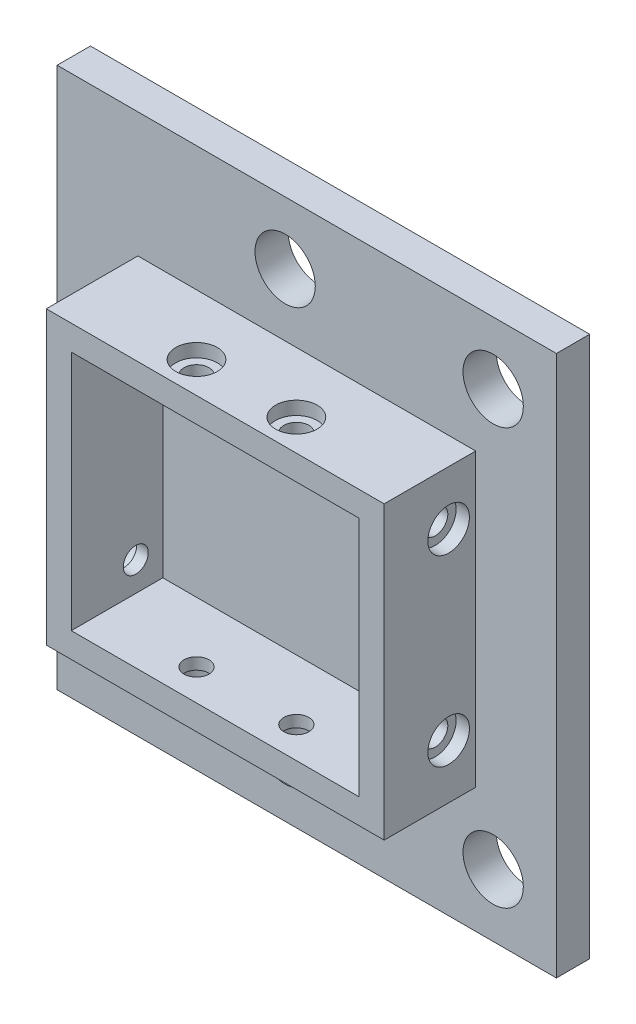
ISO-10303-21;
HEADER;
FILE_DESCRIPTION(('STEP AP214'),'2;1');
FILE_NAME('part.step','',(''),(''),'','','');
FILE_SCHEMA(('AUTOMOTIVE_DESIGN { 1 0 10303 214 1 1 1 1 }'));
ENDSEC;
DATA;
#1=APPLICATION_CONTEXT('core data for automotive mechanical design processes');
#2=APPLICATION_PROTOCOL_DEFINITION('international standard','automotive_design',2000,#1);
#3=PRODUCT_CONTEXT('',#1,'mechanical');
#4=PRODUCT('Part','Part','',(#3));
#5=PRODUCT_RELATED_PRODUCT_CATEGORY('part','',(#4));
#6=PRODUCT_DEFINITION_FORMATION('','',#4);
#7=PRODUCT_DEFINITION_CONTEXT('part definition',#1,'design');
#8=PRODUCT_DEFINITION('design','',#6,#7);
#9=PRODUCT_DEFINITION_SHAPE('','',#8);
#10=(LENGTH_UNIT() NAMED_UNIT(*) SI_UNIT(.MILLI.,.METRE.));
#11=(NAMED_UNIT(*) PLANE_ANGLE_UNIT() SI_UNIT($,.RADIAN.));
#12=(NAMED_UNIT(*) SI_UNIT($,.STERADIAN.) SOLID_ANGLE_UNIT());
#13=UNCERTAINTY_MEASURE_WITH_UNIT(LENGTH_MEASURE(1.E-05),#10,'distance_accuracy_value','');
#14=(GEOMETRIC_REPRESENTATION_CONTEXT(3) GLOBAL_UNCERTAINTY_ASSIGNED_CONTEXT((#13)) GLOBAL_UNIT_ASSIGNED_CONTEXT((#10,
#11,#12)) REPRESENTATION_CONTEXT('',''));
#15=CARTESIAN_POINT('',(0.,0.,0.));
#16=DIRECTION('',(0.,0.,1.));
#17=DIRECTION('',(1.,0.,0.));
#18=AXIS2_PLACEMENT_3D('',#15,#16,#17);
#19=CARTESIAN_POINT('',(30.,11.,7.25));
#20=DIRECTION('',(-1.,0.,0.));
#21=DIRECTION('',(0.,0.,1.));
#22=AXIS2_PLACEMENT_3D('',#19,#20,#21);
#23=CYLINDRICAL_SURFACE('',#22,1.5);
#24=CARTESIAN_POINT('',(17.3,11.,7.25));
#25=DIRECTION('',(-1.,0.,0.));
#26=DIRECTION('',(0.,0.,1.));
#27=AXIS2_PLACEMENT_3D('',#24,#25,#26);
#28=CIRCLE('',#27,1.5);
#29=CARTESIAN_POINT('',(17.3,11.,8.75));
#30=VERTEX_POINT('',#29);
#31=EDGE_CURVE('E273',#30,#30,#28,.T.);
#32=ORIENTED_EDGE('',*,*,#31,.T.);
#33=EDGE_LOOP('',(#32));
#34=FACE_BOUND('',#33,.T.);
#35=CARTESIAN_POINT('',(18.7,11.,7.25));
#36=DIRECTION('',(1.,0.,0.));
#37=DIRECTION('',(0.,0.,-1.));
#38=AXIS2_PLACEMENT_3D('',#35,#36,#37);
#39=CIRCLE('',#38,1.5);
#40=CARTESIAN_POINT('',(18.7,11.,5.75));
#41=VERTEX_POINT('',#40);
#42=EDGE_CURVE('E284',#41,#41,#39,.F.);
#43=ORIENTED_EDGE('',*,*,#42,.F.);
#44=EDGE_LOOP('',(#43));
#45=FACE_BOUND('',#44,.T.);
#46=ADVANCED_FACE('F32',(#34,#45),#23,.F.);
#47=CARTESIAN_POINT('',(-17.3,11.,7.25));
#48=DIRECTION('',(1.,0.,0.));
#49=DIRECTION('',(0.,0.,-1.));
#50=AXIS2_PLACEMENT_3D('',#47,#48,#49);
#51=CIRCLE('',#50,1.5);
#52=CARTESIAN_POINT('',(-17.3,11.,5.75));
#53=VERTEX_POINT('',#52);
#54=EDGE_CURVE('E272',#53,#53,#51,.T.);
#55=ORIENTED_EDGE('',*,*,#54,.T.);
#56=EDGE_LOOP('',(#55));
#57=FACE_BOUND('',#56,.T.);
#58=CARTESIAN_POINT('',(-18.7,11.,7.25));
#59=DIRECTION('',(-1.,0.,0.));
#60=DIRECTION('',(0.,0.,1.));
#61=AXIS2_PLACEMENT_3D('',#58,#59,#60);
#62=CIRCLE('',#61,1.5);
#63=CARTESIAN_POINT('',(-18.7,11.,8.75));
#64=VERTEX_POINT('',#63);
#65=EDGE_CURVE('E276',#64,#64,#62,.F.);
#66=ORIENTED_EDGE('',*,*,#65,.F.);
#67=EDGE_LOOP('',(#66));
#68=FACE_BOUND('',#67,.T.);
#69=ADVANCED_FACE('F353',(#57,#68),#23,.F.);
#70=CARTESIAN_POINT('',(-6.00000000000001,32.5,11.25));
#71=DIRECTION('',(0.,-1.,0.));
#72=DIRECTION('',(1.,0.,0.));
#73=AXIS2_PLACEMENT_3D('',#70,#71,#72);
#74=CYLINDRICAL_SURFACE('',#73,1.5);
#75=CARTESIAN_POINT('',(-6.,14.5,11.25));
#76=DIRECTION('',(0.,-1.,0.));
#77=DIRECTION('',(1.,0.,0.));
#78=AXIS2_PLACEMENT_3D('',#75,#76,#77);
#79=CIRCLE('',#78,1.5);
#80=CARTESIAN_POINT('',(-4.5,14.5,11.25));
#81=VERTEX_POINT('',#80);
#82=EDGE_CURVE('E242',#81,#81,#79,.T.);
#83=ORIENTED_EDGE('',*,*,#82,.T.);
#84=EDGE_LOOP('',(#83));
#85=FACE_BOUND('',#84,.T.);
#86=CARTESIAN_POINT('',(-6.,15.9,11.25));
#87=DIRECTION('',(0.,1.,0.));
#88=DIRECTION('',(-1.,0.,0.));
#89=AXIS2_PLACEMENT_3D('',#86,#87,#88);
#90=CIRCLE('',#89,1.5);
#91=CARTESIAN_POINT('',(-7.5,15.9,11.25));
#92=VERTEX_POINT('',#91);
#93=EDGE_CURVE('E258',#92,#92,#90,.F.);
#94=ORIENTED_EDGE('',*,*,#93,.F.);
#95=EDGE_LOOP('',(#94));
#96=FACE_BOUND('',#95,.T.);
#97=ADVANCED_FACE('F359',(#85,#96),#74,.F.);
#98=CARTESIAN_POINT('',(-6.,-14.5,11.25));
#99=DIRECTION('',(0.,1.,0.));
#100=DIRECTION('',(-1.,0.,0.));
#101=AXIS2_PLACEMENT_3D('',#98,#99,#100);
#102=CIRCLE('',#101,1.5);
#103=CARTESIAN_POINT('',(-7.5,-14.5,11.25));
#104=VERTEX_POINT('',#103);
#105=EDGE_CURVE('E156',#104,#104,#102,.T.);
#106=ORIENTED_EDGE('',*,*,#105,.T.);
#107=EDGE_LOOP('',(#106));
#108=FACE_BOUND('',#107,.T.);
#109=CARTESIAN_POINT('',(-6.,-15.9,11.25));
#110=DIRECTION('',(0.,-1.,0.));
#111=DIRECTION('',(1.,0.,0.));
#112=AXIS2_PLACEMENT_3D('',#109,#110,#111);
#113=CIRCLE('',#112,1.5);
#114=CARTESIAN_POINT('',(-4.5,-15.9,11.25));
#115=VERTEX_POINT('',#114);
#116=EDGE_CURVE('E249',#115,#115,#113,.F.);
#117=ORIENTED_EDGE('',*,*,#116,.F.);
#118=EDGE_LOOP('',(#117));
#119=FACE_BOUND('',#118,.T.);
#120=ADVANCED_FACE('F334',(#108,#119),#74,.F.);
#121=CARTESIAN_POINT('',(0.,0.,4.));
#122=DIRECTION('',(0.,0.,1.));
#123=DIRECTION('',(1.,0.,0.));
#124=AXIS2_PLACEMENT_3D('',#121,#122,#123);
#125=PLANE('',#124);
#126=CARTESIAN_POINT('',(22.4,-25.,4.));
#127=DIRECTION('',(0.,0.,1.));
#128=DIRECTION('',(1.,0.,0.));
#129=AXIS2_PLACEMENT_3D('',#126,#127,#128);
#130=CIRCLE('',#129,3.625);
#131=CARTESIAN_POINT('',(26.025,-25.,4.));
#132=VERTEX_POINT('',#131);
#133=EDGE_CURVE('E193',#132,#132,#130,.T.);
#134=ORIENTED_EDGE('',*,*,#133,.F.);
#135=EDGE_LOOP('',(#134));
#136=FACE_BOUND('',#135,.T.);
#137=CARTESIAN_POINT('',(-2.6,-25.,4.));
#138=DIRECTION('',(0.,0.,1.));
#139=DIRECTION('',(1.,0.,0.));
#140=AXIS2_PLACEMENT_3D('',#137,#138,#139);
#141=CIRCLE('',#140,3.625);
#142=CARTESIAN_POINT('',(1.025,-25.,4.));
#143=VERTEX_POINT('',#142);
#144=EDGE_CURVE('E205',#143,#143,#141,.T.);
#145=ORIENTED_EDGE('',*,*,#144,.F.);
#146=EDGE_LOOP('',(#145));
#147=FACE_BOUND('',#146,.T.);
#148=DIRECTION('',(0.,-1.,0.));
#149=VECTOR('',#148,1.);
#150=CARTESIAN_POINT('',(-30.,-32.5,4.));
#151=LINE('',#150,#149);
#152=CARTESIAN_POINT('',(-30.,32.5,4.));
#153=VERTEX_POINT('',#152);
#154=CARTESIAN_POINT('',(-30.,-32.5,4.));
#155=VERTEX_POINT('',#154);
#156=EDGE_CURVE('E217',#153,#155,#151,.T.);
#157=ORIENTED_EDGE('',*,*,#156,.T.);
#158=DIRECTION('',(1.,0.,0.));
#159=VECTOR('',#158,1.);
#160=CARTESIAN_POINT('',(30.,-32.5,4.));
#161=LINE('',#160,#159);
#162=CARTESIAN_POINT('',(30.,-32.5,4.));
#163=VERTEX_POINT('',#162);
#164=EDGE_CURVE('E220',#155,#163,#161,.T.);
#165=ORIENTED_EDGE('',*,*,#164,.T.);
#166=DIRECTION('',(0.,1.,0.));
#167=VECTOR('',#166,1.);
#168=CARTESIAN_POINT('',(30.,-32.5,4.));
#169=LINE('',#168,#167);
#170=CARTESIAN_POINT('',(30.,32.5,4.));
#171=VERTEX_POINT('',#170);
#172=EDGE_CURVE('E223',#163,#171,#169,.T.);
#173=ORIENTED_EDGE('',*,*,#172,.T.);
#174=DIRECTION('',(-1.,0.,0.));
#175=VECTOR('',#174,1.);
#176=CARTESIAN_POINT('',(30.,32.5,4.));
#177=LINE('',#176,#175);
#178=EDGE_CURVE('E225',#171,#153,#177,.T.);
#179=ORIENTED_EDGE('',*,*,#178,.T.);
#180=EDGE_LOOP('',(#157,#165,#173,#179));
#181=FACE_BOUND('',#180,.T.);
#182=CARTESIAN_POINT('',(-2.6,25.,4.));
#183=DIRECTION('',(0.,0.,1.));
#184=DIRECTION('',(1.,0.,0.));
#185=AXIS2_PLACEMENT_3D('',#182,#183,#184);
#186=CIRCLE('',#185,3.625);
#187=CARTESIAN_POINT('',(1.025,25.,4.));
#188=VERTEX_POINT('',#187);
#189=EDGE_CURVE('E211',#188,#188,#186,.T.);
#190=ORIENTED_EDGE('',*,*,#189,.F.);
#191=EDGE_LOOP('',(#190));
#192=FACE_BOUND('',#191,.T.);
#193=CARTESIAN_POINT('',(22.4,25.,4.));
#194=DIRECTION('',(0.,0.,1.));
#195=DIRECTION('',(1.,0.,0.));
#196=AXIS2_PLACEMENT_3D('',#193,#194,#195);
#197=CIRCLE('',#196,3.625);
#198=CARTESIAN_POINT('',(26.025,25.,4.));
#199=VERTEX_POINT('',#198);
#200=EDGE_CURVE('E199',#199,#199,#197,.T.);
#201=ORIENTED_EDGE('',*,*,#200,.F.);
#202=EDGE_LOOP('',(#201));
#203=FACE_BOUND('',#202,.T.);
#204=DIRECTION('',(1.,0.,0.));
#205=VECTOR('',#204,1.);
#206=CARTESIAN_POINT('',(20.3,-17.5,4.));
#207=LINE('',#206,#205);
#208=CARTESIAN_POINT('',(-20.3,-17.5,4.));
#209=VERTEX_POINT('',#208);
#210=CARTESIAN_POINT('',(20.3,-17.5,4.));
#211=VERTEX_POINT('',#210);
#212=EDGE_CURVE('E179',#209,#211,#207,.T.);
#213=ORIENTED_EDGE('',*,*,#212,.F.);
#214=DIRECTION('',(0.,-1.,0.));
#215=VECTOR('',#214,1.);
#216=CARTESIAN_POINT('',(-20.3,-17.5,4.));
#217=LINE('',#216,#215);
#218=CARTESIAN_POINT('',(-20.3,17.5,4.));
#219=VERTEX_POINT('',#218);
#220=EDGE_CURVE('E142',#219,#209,#217,.T.);
#221=ORIENTED_EDGE('',*,*,#220,.F.);
#222=DIRECTION('',(-1.,0.,0.));
#223=VECTOR('',#222,1.);
#224=CARTESIAN_POINT('',(20.3,17.5,4.));
#225=LINE('',#224,#223);
#226=CARTESIAN_POINT('',(20.3,17.5,4.));
#227=VERTEX_POINT('',#226);
#228=EDGE_CURVE('E170',#227,#219,#225,.T.);
#229=ORIENTED_EDGE('',*,*,#228,.F.);
#230=DIRECTION('',(0.,1.,0.));
#231=VECTOR('',#230,1.);
#232=CARTESIAN_POINT('',(20.3,-17.5,4.));
#233=LINE('',#232,#231);
#234=EDGE_CURVE('E181',#211,#227,#233,.T.);
#235=ORIENTED_EDGE('',*,*,#234,.F.);
#236=EDGE_LOOP('',(#213,#221,#229,#235));
#237=FACE_BOUND('',#236,.T.);
#238=ADVANCED_FACE('F418',(#136,#147,#181,#192,#203,#237),#125,.T.);
#239=CARTESIAN_POINT('',(0.,0.,0.));
#240=DIRECTION('',(0.,0.,1.));
#241=DIRECTION('',(1.,0.,0.));
#242=AXIS2_PLACEMENT_3D('',#239,#240,#241);
#243=PLANE('',#242);
#244=DIRECTION('',(0.,-1.,0.));
#245=VECTOR('',#244,1.);
#246=CARTESIAN_POINT('',(-30.,-32.5,0.));
#247=LINE('',#246,#245);
#248=CARTESIAN_POINT('',(-30.,32.5,0.));
#249=VERTEX_POINT('',#248);
#250=CARTESIAN_POINT('',(-30.,-32.5,0.));
#251=VERTEX_POINT('',#250);
#252=EDGE_CURVE('E214',#249,#251,#247,.T.);
#253=ORIENTED_EDGE('',*,*,#252,.F.);
#254=DIRECTION('',(-1.,0.,0.));
#255=VECTOR('',#254,1.);
#256=CARTESIAN_POINT('',(30.,32.5,0.));
#257=LINE('',#256,#255);
#258=CARTESIAN_POINT('',(30.,32.5,0.));
#259=VERTEX_POINT('',#258);
#260=EDGE_CURVE('E221',#259,#249,#257,.T.);
#261=ORIENTED_EDGE('',*,*,#260,.F.);
#262=DIRECTION('',(0.,1.,0.));
#263=VECTOR('',#262,1.);
#264=CARTESIAN_POINT('',(30.,-32.5,0.));
#265=LINE('',#264,#263);
#266=CARTESIAN_POINT('',(30.,-32.5,0.));
#267=VERTEX_POINT('',#266);
#268=EDGE_CURVE('E232',#267,#259,#265,.T.);
#269=ORIENTED_EDGE('',*,*,#268,.F.);
#270=DIRECTION('',(1.,0.,0.));
#271=VECTOR('',#270,1.);
#272=CARTESIAN_POINT('',(30.,-32.5,0.));
#273=LINE('',#272,#271);
#274=EDGE_CURVE('E230',#251,#267,#273,.T.);
#275=ORIENTED_EDGE('',*,*,#274,.F.);
#276=EDGE_LOOP('',(#253,#261,#269,#275));
#277=FACE_BOUND('',#276,.T.);
#278=CARTESIAN_POINT('',(-2.6,25.,0.));
#279=DIRECTION('',(0.,0.,1.));
#280=DIRECTION('',(1.,0.,0.));
#281=AXIS2_PLACEMENT_3D('',#278,#279,#280);
#282=CIRCLE('',#281,3.625);
#283=CARTESIAN_POINT('',(1.025,25.,0.));
#284=VERTEX_POINT('',#283);
#285=EDGE_CURVE('E208',#284,#284,#282,.T.);
#286=ORIENTED_EDGE('',*,*,#285,.T.);
#287=EDGE_LOOP('',(#286));
#288=FACE_BOUND('',#287,.T.);
#289=CARTESIAN_POINT('',(-2.6,-25.,0.));
#290=DIRECTION('',(0.,0.,1.));
#291=DIRECTION('',(1.,0.,0.));
#292=AXIS2_PLACEMENT_3D('',#289,#290,#291);
#293=CIRCLE('',#292,3.625);
#294=CARTESIAN_POINT('',(1.025,-25.,0.));
#295=VERTEX_POINT('',#294);
#296=EDGE_CURVE('E202',#295,#295,#293,.T.);
#297=ORIENTED_EDGE('',*,*,#296,.T.);
#298=EDGE_LOOP('',(#297));
#299=FACE_BOUND('',#298,.T.);
#300=CARTESIAN_POINT('',(22.4,25.,0.));
#301=DIRECTION('',(0.,0.,1.));
#302=DIRECTION('',(1.,0.,0.));
#303=AXIS2_PLACEMENT_3D('',#300,#301,#302);
#304=CIRCLE('',#303,3.625);
#305=CARTESIAN_POINT('',(26.025,25.,0.));
#306=VERTEX_POINT('',#305);
#307=EDGE_CURVE('E196',#306,#306,#304,.T.);
#308=ORIENTED_EDGE('',*,*,#307,.T.);
#309=EDGE_LOOP('',(#308));
#310=FACE_BOUND('',#309,.T.);
#311=CARTESIAN_POINT('',(22.4,-25.,0.));
#312=DIRECTION('',(0.,0.,1.));
#313=DIRECTION('',(1.,0.,0.));
#314=AXIS2_PLACEMENT_3D('',#311,#312,#313);
#315=CIRCLE('',#314,3.625);
#316=CARTESIAN_POINT('',(26.025,-25.,0.));
#317=VERTEX_POINT('',#316);
#318=EDGE_CURVE('E192',#317,#317,#315,.T.);
#319=ORIENTED_EDGE('',*,*,#318,.T.);
#320=EDGE_LOOP('',(#319));
#321=FACE_BOUND('',#320,.T.);
#322=ADVANCED_FACE('F435',(#277,#288,#299,#310,#321),#243,.F.);
#323=CARTESIAN_POINT('',(-30.,-32.5,4.));
#324=DIRECTION('',(1.,0.,0.));
#325=DIRECTION('',(0.,0.,-1.));
#326=AXIS2_PLACEMENT_3D('',#323,#324,#325);
#327=PLANE('',#326);
#328=ORIENTED_EDGE('',*,*,#252,.T.);
#329=DIRECTION('',(0.,0.,-1.));
#330=VECTOR('',#329,1.);
#331=CARTESIAN_POINT('',(-30.,-32.5,4.));
#332=LINE('',#331,#330);
#333=EDGE_CURVE('E11',#155,#251,#332,.T.);
#334=ORIENTED_EDGE('',*,*,#333,.F.);
#335=ORIENTED_EDGE('',*,*,#156,.F.);
#336=DIRECTION('',(0.,0.,-1.));
#337=VECTOR('',#336,1.);
#338=CARTESIAN_POINT('',(-30.,32.5,4.));
#339=LINE('',#338,#337);
#340=EDGE_CURVE('E227',#153,#249,#339,.T.);
#341=ORIENTED_EDGE('',*,*,#340,.T.);
#342=EDGE_LOOP('',(#328,#334,#335,#341));
#343=FACE_BOUND('',#342,.T.);
#344=ADVANCED_FACE('F34',(#343),#327,.F.);
#345=CARTESIAN_POINT('',(30.,-32.5,4.));
#346=DIRECTION('',(0.,1.,0.));
#347=DIRECTION('',(0.,0.,1.));
#348=AXIS2_PLACEMENT_3D('',#345,#346,#347);
#349=PLANE('',#348);
#350=ORIENTED_EDGE('',*,*,#274,.T.);
#351=DIRECTION('',(0.,0.,-1.));
#352=VECTOR('',#351,1.);
#353=CARTESIAN_POINT('',(30.,-32.5,4.));
#354=LINE('',#353,#352);
#355=EDGE_CURVE('E41',#163,#267,#354,.T.);
#356=ORIENTED_EDGE('',*,*,#355,.F.);
#357=ORIENTED_EDGE('',*,*,#164,.F.);
#358=ORIENTED_EDGE('',*,*,#333,.T.);
#359=EDGE_LOOP('',(#350,#356,#357,#358));
#360=FACE_BOUND('',#359,.T.);
#361=ADVANCED_FACE('F522',(#360),#349,.F.);
#362=CARTESIAN_POINT('',(30.,-32.5,4.));
#363=DIRECTION('',(-1.,0.,0.));
#364=DIRECTION('',(0.,0.,1.));
#365=AXIS2_PLACEMENT_3D('',#362,#363,#364);
#366=PLANE('',#365);
#367=ORIENTED_EDGE('',*,*,#268,.T.);
#368=DIRECTION('',(0.,0.,-1.));
#369=VECTOR('',#368,1.);
#370=CARTESIAN_POINT('',(30.,32.5,4.));
#371=LINE('',#370,#369);
#372=EDGE_CURVE('E237',#171,#259,#371,.T.);
#373=ORIENTED_EDGE('',*,*,#372,.F.);
#374=ORIENTED_EDGE('',*,*,#172,.F.);
#375=ORIENTED_EDGE('',*,*,#355,.T.);
#376=EDGE_LOOP('',(#367,#373,#374,#375));
#377=FACE_BOUND('',#376,.T.);
#378=ADVANCED_FACE('F504',(#377),#366,.F.);
#379=CARTESIAN_POINT('',(30.,32.5,4.));
#380=DIRECTION('',(0.,-1.,0.));
#381=DIRECTION('',(0.,0.,-1.));
#382=AXIS2_PLACEMENT_3D('',#379,#380,#381);
#383=PLANE('',#382);
#384=ORIENTED_EDGE('',*,*,#260,.T.);
#385=ORIENTED_EDGE('',*,*,#340,.F.);
#386=ORIENTED_EDGE('',*,*,#178,.F.);
#387=ORIENTED_EDGE('',*,*,#372,.T.);
#388=EDGE_LOOP('',(#384,#385,#386,#387));
#389=FACE_BOUND('',#388,.T.);
#390=ADVANCED_FACE('F499',(#389),#383,.F.);
#391=CARTESIAN_POINT('',(-2.6,25.,4.));
#392=DIRECTION('',(0.,0.,-1.));
#393=DIRECTION('',(-1.,0.,0.));
#394=AXIS2_PLACEMENT_3D('',#391,#392,#393);
#395=CYLINDRICAL_SURFACE('',#394,3.625);
#396=ORIENTED_EDGE('',*,*,#189,.T.);
#397=EDGE_LOOP('',(#396));
#398=FACE_BOUND('',#397,.T.);
#399=ORIENTED_EDGE('',*,*,#285,.F.);
#400=EDGE_LOOP('',(#399));
#401=FACE_BOUND('',#400,.T.);
#402=ADVANCED_FACE('F496',(#398,#401),#395,.F.);
#403=CARTESIAN_POINT('',(-2.6,-25.,4.));
#404=DIRECTION('',(0.,0.,-1.));
#405=DIRECTION('',(-1.,0.,0.));
#406=AXIS2_PLACEMENT_3D('',#403,#404,#405);
#407=CYLINDRICAL_SURFACE('',#406,3.625);
#408=ORIENTED_EDGE('',*,*,#144,.T.);
#409=EDGE_LOOP('',(#408));
#410=FACE_BOUND('',#409,.T.);
#411=ORIENTED_EDGE('',*,*,#296,.F.);
#412=EDGE_LOOP('',(#411));
#413=FACE_BOUND('',#412,.T.);
#414=ADVANCED_FACE('F493',(#410,#413),#407,.F.);
#415=CARTESIAN_POINT('',(22.4,25.,4.));
#416=DIRECTION('',(0.,0.,-1.));
#417=DIRECTION('',(-1.,0.,0.));
#418=AXIS2_PLACEMENT_3D('',#415,#416,#417);
#419=CYLINDRICAL_SURFACE('',#418,3.625);
#420=ORIENTED_EDGE('',*,*,#200,.T.);
#421=EDGE_LOOP('',(#420));
#422=FACE_BOUND('',#421,.T.);
#423=ORIENTED_EDGE('',*,*,#307,.F.);
#424=EDGE_LOOP('',(#423));
#425=FACE_BOUND('',#424,.T.);
#426=ADVANCED_FACE('F489',(#422,#425),#419,.F.);
#427=CARTESIAN_POINT('',(22.4,-25.,4.));
#428=DIRECTION('',(0.,0.,-1.));
#429=DIRECTION('',(-1.,0.,0.));
#430=AXIS2_PLACEMENT_3D('',#427,#428,#429);
#431=CYLINDRICAL_SURFACE('',#430,3.625);
#432=ORIENTED_EDGE('',*,*,#133,.T.);
#433=EDGE_LOOP('',(#432));
#434=FACE_BOUND('',#433,.T.);
#435=ORIENTED_EDGE('',*,*,#318,.F.);
#436=EDGE_LOOP('',(#435));
#437=FACE_BOUND('',#436,.T.);
#438=ADVANCED_FACE('F486',(#434,#437),#431,.F.);
#439=CARTESIAN_POINT('',(0.,0.,15.));
#440=DIRECTION('',(0.,0.,1.));
#441=DIRECTION('',(1.,0.,0.));
#442=AXIS2_PLACEMENT_3D('',#439,#440,#441);
#443=PLANE('',#442);
#444=DIRECTION('',(0.,-1.,0.));
#445=VECTOR('',#444,1.);
#446=CARTESIAN_POINT('',(-20.3,-17.5,15.));
#447=LINE('',#446,#445);
#448=CARTESIAN_POINT('',(-20.3,17.5,15.));
#449=VERTEX_POINT('',#448);
#450=CARTESIAN_POINT('',(-20.3,-17.5,15.));
#451=VERTEX_POINT('',#450);
#452=EDGE_CURVE('E166',#449,#451,#447,.T.);
#453=ORIENTED_EDGE('',*,*,#452,.T.);
#454=DIRECTION('',(1.,0.,0.));
#455=VECTOR('',#454,1.);
#456=CARTESIAN_POINT('',(20.3,-17.5,15.));
#457=LINE('',#456,#455);
#458=CARTESIAN_POINT('',(20.3,-17.5,15.));
#459=VERTEX_POINT('',#458);
#460=EDGE_CURVE('E169',#451,#459,#457,.T.);
#461=ORIENTED_EDGE('',*,*,#460,.T.);
#462=DIRECTION('',(0.,1.,0.));
#463=VECTOR('',#462,1.);
#464=CARTESIAN_POINT('',(20.3,-17.5,15.));
#465=LINE('',#464,#463);
#466=CARTESIAN_POINT('',(20.3,17.5,15.));
#467=VERTEX_POINT('',#466);
#468=EDGE_CURVE('E172',#459,#467,#465,.T.);
#469=ORIENTED_EDGE('',*,*,#468,.T.);
#470=DIRECTION('',(-1.,0.,0.));
#471=VECTOR('',#470,1.);
#472=CARTESIAN_POINT('',(20.3,17.5,15.));
#473=LINE('',#472,#471);
#474=EDGE_CURVE('E174',#467,#449,#473,.T.);
#475=ORIENTED_EDGE('',*,*,#474,.T.);
#476=EDGE_LOOP('',(#453,#461,#469,#475));
#477=FACE_BOUND('',#476,.T.);
#478=DIRECTION('',(1.,0.,0.));
#479=VECTOR('',#478,1.);
#480=CARTESIAN_POINT('',(17.3,-14.5,15.));
#481=LINE('',#480,#479);
#482=CARTESIAN_POINT('',(-17.3,-14.5,15.));
#483=VERTEX_POINT('',#482);
#484=CARTESIAN_POINT('',(17.3,-14.5,15.));
#485=VERTEX_POINT('',#484);
#486=EDGE_CURVE('E134',#483,#485,#481,.T.);
#487=ORIENTED_EDGE('',*,*,#486,.F.);
#488=DIRECTION('',(0.,-1.,0.));
#489=VECTOR('',#488,1.);
#490=CARTESIAN_POINT('',(-17.3,-14.5,15.));
#491=LINE('',#490,#489);
#492=CARTESIAN_POINT('',(-17.3,14.5,15.));
#493=VERTEX_POINT('',#492);
#494=EDGE_CURVE('E125',#493,#483,#491,.T.);
#495=ORIENTED_EDGE('',*,*,#494,.F.);
#496=DIRECTION('',(-1.,0.,0.));
#497=VECTOR('',#496,1.);
#498=CARTESIAN_POINT('',(17.3,14.5,15.));
#499=LINE('',#498,#497);
#500=CARTESIAN_POINT('',(17.3,14.5,15.));
#501=VERTEX_POINT('',#500);
#502=EDGE_CURVE('E150',#501,#493,#499,.T.);
#503=ORIENTED_EDGE('',*,*,#502,.F.);
#504=DIRECTION('',(0.,1.,0.));
#505=VECTOR('',#504,1.);
#506=CARTESIAN_POINT('',(17.3,-14.5,15.));
#507=LINE('',#506,#505);
#508=EDGE_CURVE('E148',#485,#501,#507,.T.);
#509=ORIENTED_EDGE('',*,*,#508,.F.);
#510=EDGE_LOOP('',(#487,#495,#503,#509));
#511=FACE_BOUND('',#510,.T.);
#512=ADVANCED_FACE('F146',(#477,#511),#443,.T.);
#513=CARTESIAN_POINT('',(-20.3,-17.5,15.));
#514=DIRECTION('',(1.,0.,0.));
#515=DIRECTION('',(0.,0.,-1.));
#516=AXIS2_PLACEMENT_3D('',#513,#514,#515);
#517=PLANE('',#516);
#518=CARTESIAN_POINT('',(-20.3,-11.,7.25));
#519=DIRECTION('',(-1.,0.,0.));
#520=DIRECTION('',(0.,0.,-1.));
#521=AXIS2_PLACEMENT_3D('',#518,#519,#520);
#522=CIRCLE('',#521,2.5);
#523=CARTESIAN_POINT('',(-20.3,-11.,4.75));
#524=VERTEX_POINT('',#523);
#525=EDGE_CURVE('E286',#524,#524,#522,.T.);
#526=ORIENTED_EDGE('',*,*,#525,.F.);
#527=EDGE_LOOP('',(#526));
#528=FACE_BOUND('',#527,.T.);
#529=CARTESIAN_POINT('',(-20.3,11.,7.25));
#530=DIRECTION('',(-1.,0.,0.));
#531=DIRECTION('',(0.,0.,1.));
#532=AXIS2_PLACEMENT_3D('',#529,#530,#531);
#533=CIRCLE('',#532,2.5);
#534=CARTESIAN_POINT('',(-20.3,11.,9.75));
#535=VERTEX_POINT('',#534);
#536=EDGE_CURVE('E282',#535,#535,#533,.T.);
#537=ORIENTED_EDGE('',*,*,#536,.F.);
#538=EDGE_LOOP('',(#537));
#539=FACE_BOUND('',#538,.T.);
#540=ORIENTED_EDGE('',*,*,#220,.T.);
#541=DIRECTION('',(0.,0.,-1.));
#542=VECTOR('',#541,1.);
#543=CARTESIAN_POINT('',(-20.3,-17.5,15.));
#544=LINE('',#543,#542);
#545=EDGE_CURVE('E190',#451,#209,#544,.T.);
#546=ORIENTED_EDGE('',*,*,#545,.F.);
#547=ORIENTED_EDGE('',*,*,#452,.F.);
#548=DIRECTION('',(0.,0.,-1.));
#549=VECTOR('',#548,1.);
#550=CARTESIAN_POINT('',(-20.3,17.5,15.));
#551=LINE('',#550,#549);
#552=EDGE_CURVE('E176',#449,#219,#551,.T.);
#553=ORIENTED_EDGE('',*,*,#552,.T.);
#554=EDGE_LOOP('',(#540,#546,#547,#553));
#555=FACE_BOUND('',#554,.T.);
#556=ADVANCED_FACE('F468',(#528,#539,#555),#517,.F.);
#557=CARTESIAN_POINT('',(20.3,-17.5,15.));
#558=DIRECTION('',(0.,1.,0.));
#559=DIRECTION('',(-1.,0.,0.));
#560=AXIS2_PLACEMENT_3D('',#557,#558,#559);
#561=PLANE('',#560);
#562=CARTESIAN_POINT('',(6.,-17.5,11.25));
#563=DIRECTION('',(0.,-1.,0.));
#564=DIRECTION('',(-1.,0.,0.));
#565=AXIS2_PLACEMENT_3D('',#562,#563,#564);
#566=CIRCLE('',#565,2.5);
#567=CARTESIAN_POINT('',(3.5,-17.5,11.25));
#568=VERTEX_POINT('',#567);
#569=EDGE_CURVE('E261',#568,#568,#566,.T.);
#570=ORIENTED_EDGE('',*,*,#569,.F.);
#571=EDGE_LOOP('',(#570));
#572=FACE_BOUND('',#571,.T.);
#573=CARTESIAN_POINT('',(-6.,-17.5,11.25));
#574=DIRECTION('',(0.,-1.,0.));
#575=DIRECTION('',(1.,0.,0.));
#576=AXIS2_PLACEMENT_3D('',#573,#574,#575);
#577=CIRCLE('',#576,2.5);
#578=CARTESIAN_POINT('',(-3.5,-17.5,11.25));
#579=VERTEX_POINT('',#578);
#580=EDGE_CURVE('E256',#579,#579,#577,.T.);
#581=ORIENTED_EDGE('',*,*,#580,.F.);
#582=EDGE_LOOP('',(#581));
#583=FACE_BOUND('',#582,.T.);
#584=ORIENTED_EDGE('',*,*,#212,.T.);
#585=DIRECTION('',(0.,0.,-1.));
#586=VECTOR('',#585,1.);
#587=CARTESIAN_POINT('',(20.3,-17.5,15.));
#588=LINE('',#587,#586);
#589=EDGE_CURVE('E187',#459,#211,#588,.T.);
#590=ORIENTED_EDGE('',*,*,#589,.F.);
#591=ORIENTED_EDGE('',*,*,#460,.F.);
#592=ORIENTED_EDGE('',*,*,#545,.T.);
#593=EDGE_LOOP('',(#584,#590,#591,#592));
#594=FACE_BOUND('',#593,.T.);
#595=ADVANCED_FACE('F459',(#572,#583,#594),#561,.F.);
#596=CARTESIAN_POINT('',(20.3,-17.5,15.));
#597=DIRECTION('',(-1.,0.,0.));
#598=DIRECTION('',(0.,0.,1.));
#599=AXIS2_PLACEMENT_3D('',#596,#597,#598);
#600=PLANE('',#599);
#601=CARTESIAN_POINT('',(20.3,-11.,7.25));
#602=DIRECTION('',(-1.,0.,0.));
#603=DIRECTION('',(0.,0.,-1.));
#604=AXIS2_PLACEMENT_3D('',#601,#602,#603);
#605=CIRCLE('',#604,2.5);
#606=CARTESIAN_POINT('',(20.3,-11.,4.75));
#607=VERTEX_POINT('',#606);
#608=EDGE_CURVE('E300',#607,#607,#605,.T.);
#609=ORIENTED_EDGE('',*,*,#608,.T.);
#610=EDGE_LOOP('',(#609));
#611=FACE_BOUND('',#610,.T.);
#612=CARTESIAN_POINT('',(20.3,11.,7.25));
#613=DIRECTION('',(-1.,0.,0.));
#614=DIRECTION('',(0.,0.,1.));
#615=AXIS2_PLACEMENT_3D('',#612,#613,#614);
#616=CIRCLE('',#615,2.5);
#617=CARTESIAN_POINT('',(20.3,11.,9.75));
#618=VERTEX_POINT('',#617);
#619=EDGE_CURVE('E293',#618,#618,#616,.T.);
#620=ORIENTED_EDGE('',*,*,#619,.T.);
#621=EDGE_LOOP('',(#620));
#622=FACE_BOUND('',#621,.T.);
#623=ORIENTED_EDGE('',*,*,#234,.T.);
#624=DIRECTION('',(0.,0.,-1.));
#625=VECTOR('',#624,1.);
#626=CARTESIAN_POINT('',(20.3,17.5,15.));
#627=LINE('',#626,#625);
#628=EDGE_CURVE('E49',#467,#227,#627,.T.);
#629=ORIENTED_EDGE('',*,*,#628,.F.);
#630=ORIENTED_EDGE('',*,*,#468,.F.);
#631=ORIENTED_EDGE('',*,*,#589,.T.);
#632=EDGE_LOOP('',(#623,#629,#630,#631));
#633=FACE_BOUND('',#632,.T.);
#634=ADVANCED_FACE('F463',(#611,#622,#633),#600,.F.);
#635=CARTESIAN_POINT('',(20.3,17.5,15.));
#636=DIRECTION('',(0.,-1.,0.));
#637=DIRECTION('',(1.,0.,0.));
#638=AXIS2_PLACEMENT_3D('',#635,#636,#637);
#639=PLANE('',#638);
#640=CARTESIAN_POINT('',(6.,17.5,11.25));
#641=DIRECTION('',(0.,-1.,0.));
#642=DIRECTION('',(-1.,0.,0.));
#643=AXIS2_PLACEMENT_3D('',#640,#641,#642);
#644=CIRCLE('',#643,2.5);
#645=CARTESIAN_POINT('',(3.5,17.5,11.25));
#646=VERTEX_POINT('',#645);
#647=EDGE_CURVE('E313',#646,#646,#644,.T.);
#648=ORIENTED_EDGE('',*,*,#647,.T.);
#649=EDGE_LOOP('',(#648));
#650=FACE_BOUND('',#649,.T.);
#651=CARTESIAN_POINT('',(-6.,17.5,11.25));
#652=DIRECTION('',(0.,-1.,0.));
#653=DIRECTION('',(1.,0.,0.));
#654=AXIS2_PLACEMENT_3D('',#651,#652,#653);
#655=CIRCLE('',#654,2.5);
#656=CARTESIAN_POINT('',(-3.5,17.5,11.25));
#657=VERTEX_POINT('',#656);
#658=EDGE_CURVE('E266',#657,#657,#655,.T.);
#659=ORIENTED_EDGE('',*,*,#658,.T.);
#660=EDGE_LOOP('',(#659));
#661=FACE_BOUND('',#660,.T.);
#662=ORIENTED_EDGE('',*,*,#228,.T.);
#663=ORIENTED_EDGE('',*,*,#552,.F.);
#664=ORIENTED_EDGE('',*,*,#474,.F.);
#665=ORIENTED_EDGE('',*,*,#628,.T.);
#666=EDGE_LOOP('',(#662,#663,#664,#665));
#667=FACE_BOUND('',#666,.T.);
#668=ADVANCED_FACE('F348',(#650,#661,#667),#639,.F.);
#669=CARTESIAN_POINT('',(-17.3,-14.5,15.));
#670=DIRECTION('',(1.,0.,0.));
#671=DIRECTION('',(0.,0.,-1.));
#672=AXIS2_PLACEMENT_3D('',#669,#670,#671);
#673=PLANE('',#672);
#674=ORIENTED_EDGE('',*,*,#54,.F.);
#675=EDGE_LOOP('',(#674));
#676=FACE_BOUND('',#675,.T.);
#677=CARTESIAN_POINT('',(-17.3,-11.,7.25));
#678=DIRECTION('',(1.,0.,0.));
#679=DIRECTION('',(0.,0.,-1.));
#680=AXIS2_PLACEMENT_3D('',#677,#678,#679);
#681=CIRCLE('',#680,1.5);
#682=CARTESIAN_POINT('',(-17.3,-11.,5.75));
#683=VERTEX_POINT('',#682);
#684=EDGE_CURVE('E271',#683,#683,#681,.T.);
#685=ORIENTED_EDGE('',*,*,#684,.F.);
#686=EDGE_LOOP('',(#685));
#687=FACE_BOUND('',#686,.T.);
#688=DIRECTION('',(0.,-1.,0.));
#689=VECTOR('',#688,1.);
#690=CARTESIAN_POINT('',(-17.3,-14.5,4.));
#691=LINE('',#690,#689);
#692=CARTESIAN_POINT('',(-17.3,14.5,4.));
#693=VERTEX_POINT('',#692);
#694=CARTESIAN_POINT('',(-17.3,-14.5,4.));
#695=VERTEX_POINT('',#694);
#696=EDGE_CURVE('E57',#693,#695,#691,.T.);
#697=ORIENTED_EDGE('',*,*,#696,.F.);
#698=DIRECTION('',(0.,0.,-1.));
#699=VECTOR('',#698,1.);
#700=CARTESIAN_POINT('',(-17.3,14.5,15.));
#701=LINE('',#700,#699);
#702=EDGE_CURVE('E130',#493,#693,#701,.T.);
#703=ORIENTED_EDGE('',*,*,#702,.F.);
#704=ORIENTED_EDGE('',*,*,#494,.T.);
#705=DIRECTION('',(0.,0.,-1.));
#706=VECTOR('',#705,1.);
#707=CARTESIAN_POINT('',(-17.3,-14.5,15.));
#708=LINE('',#707,#706);
#709=EDGE_CURVE('E128',#483,#695,#708,.T.);
#710=ORIENTED_EDGE('',*,*,#709,.T.);
#711=EDGE_LOOP('',(#697,#703,#704,#710));
#712=FACE_BOUND('',#711,.T.);
#713=ADVANCED_FACE('F127',(#676,#687,#712),#673,.T.);
#714=CARTESIAN_POINT('',(17.3,-14.5,15.));
#715=DIRECTION('',(0.,1.,0.));
#716=DIRECTION('',(-1.,0.,0.));
#717=AXIS2_PLACEMENT_3D('',#714,#715,#716);
#718=PLANE('',#717);
#719=CARTESIAN_POINT('',(6.,-14.5,11.25));
#720=DIRECTION('',(0.,1.,0.));
#721=DIRECTION('',(-1.,0.,0.));
#722=AXIS2_PLACEMENT_3D('',#719,#720,#721);
#723=CIRCLE('',#722,1.5);
#724=CARTESIAN_POINT('',(4.5,-14.5,11.25));
#725=VERTEX_POINT('',#724);
#726=EDGE_CURVE('E245',#725,#725,#723,.T.);
#727=ORIENTED_EDGE('',*,*,#726,.F.);
#728=EDGE_LOOP('',(#727));
#729=FACE_BOUND('',#728,.T.);
#730=ORIENTED_EDGE('',*,*,#105,.F.);
#731=EDGE_LOOP('',(#730));
#732=FACE_BOUND('',#731,.T.);
#733=DIRECTION('',(1.,0.,0.));
#734=VECTOR('',#733,1.);
#735=CARTESIAN_POINT('',(17.3,-14.5,4.));
#736=LINE('',#735,#734);
#737=CARTESIAN_POINT('',(17.3,-14.5,4.));
#738=VERTEX_POINT('',#737);
#739=EDGE_CURVE('E141',#695,#738,#736,.T.);
#740=ORIENTED_EDGE('',*,*,#739,.F.);
#741=ORIENTED_EDGE('',*,*,#709,.F.);
#742=ORIENTED_EDGE('',*,*,#486,.T.);
#743=DIRECTION('',(0.,0.,-1.));
#744=VECTOR('',#743,1.);
#745=CARTESIAN_POINT('',(17.3,-14.5,15.));
#746=LINE('',#745,#744);
#747=EDGE_CURVE('E143',#485,#738,#746,.T.);
#748=ORIENTED_EDGE('',*,*,#747,.T.);
#749=EDGE_LOOP('',(#740,#741,#742,#748));
#750=FACE_BOUND('',#749,.T.);
#751=ADVANCED_FACE('F138',(#729,#732,#750),#718,.T.);
#752=CARTESIAN_POINT('',(17.3,-14.5,15.));
#753=DIRECTION('',(-1.,0.,0.));
#754=DIRECTION('',(0.,0.,1.));
#755=AXIS2_PLACEMENT_3D('',#752,#753,#754);
#756=PLANE('',#755);
#757=ORIENTED_EDGE('',*,*,#31,.F.);
#758=EDGE_LOOP('',(#757));
#759=FACE_BOUND('',#758,.T.);
#760=CARTESIAN_POINT('',(17.3,-11.,7.25));
#761=DIRECTION('',(-1.,0.,0.));
#762=DIRECTION('',(0.,0.,1.));
#763=AXIS2_PLACEMENT_3D('',#760,#761,#762);
#764=CIRCLE('',#763,1.5);
#765=CARTESIAN_POINT('',(17.3,-11.,8.75));
#766=VERTEX_POINT('',#765);
#767=EDGE_CURVE('E268',#766,#766,#764,.T.);
#768=ORIENTED_EDGE('',*,*,#767,.F.);
#769=EDGE_LOOP('',(#768));
#770=FACE_BOUND('',#769,.T.);
#771=DIRECTION('',(0.,1.,0.));
#772=VECTOR('',#771,1.);
#773=CARTESIAN_POINT('',(17.3,-14.5,4.));
#774=LINE('',#773,#772);
#775=CARTESIAN_POINT('',(17.3,14.5,4.));
#776=VERTEX_POINT('',#775);
#777=EDGE_CURVE('E158',#738,#776,#774,.T.);
#778=ORIENTED_EDGE('',*,*,#777,.F.);
#779=ORIENTED_EDGE('',*,*,#747,.F.);
#780=ORIENTED_EDGE('',*,*,#508,.T.);
#781=DIRECTION('',(0.,0.,-1.));
#782=VECTOR('',#781,1.);
#783=CARTESIAN_POINT('',(17.3,14.5,15.));
#784=LINE('',#783,#782);
#785=EDGE_CURVE('E162',#501,#776,#784,.T.);
#786=ORIENTED_EDGE('',*,*,#785,.T.);
#787=EDGE_LOOP('',(#778,#779,#780,#786));
#788=FACE_BOUND('',#787,.T.);
#789=ADVANCED_FACE('F338',(#759,#770,#788),#756,.T.);
#790=CARTESIAN_POINT('',(17.3,14.5,15.));
#791=DIRECTION('',(0.,-1.,0.));
#792=DIRECTION('',(1.,0.,0.));
#793=AXIS2_PLACEMENT_3D('',#790,#791,#792);
#794=PLANE('',#793);
#795=CARTESIAN_POINT('',(6.,14.5,11.25));
#796=DIRECTION('',(0.,-1.,0.));
#797=DIRECTION('',(1.,0.,0.));
#798=AXIS2_PLACEMENT_3D('',#795,#796,#797);
#799=CIRCLE('',#798,1.5);
#800=CARTESIAN_POINT('',(7.5,14.5,11.25));
#801=VERTEX_POINT('',#800);
#802=EDGE_CURVE('E246',#801,#801,#799,.T.);
#803=ORIENTED_EDGE('',*,*,#802,.F.);
#804=EDGE_LOOP('',(#803));
#805=FACE_BOUND('',#804,.T.);
#806=ORIENTED_EDGE('',*,*,#82,.F.);
#807=EDGE_LOOP('',(#806));
#808=FACE_BOUND('',#807,.T.);
#809=DIRECTION('',(-1.,0.,0.));
#810=VECTOR('',#809,1.);
#811=CARTESIAN_POINT('',(17.3,14.5,4.));
#812=LINE('',#811,#810);
#813=EDGE_CURVE('E135',#776,#693,#812,.T.);
#814=ORIENTED_EDGE('',*,*,#813,.F.);
#815=ORIENTED_EDGE('',*,*,#785,.F.);
#816=ORIENTED_EDGE('',*,*,#502,.T.);
#817=ORIENTED_EDGE('',*,*,#702,.T.);
#818=EDGE_LOOP('',(#814,#815,#816,#817));
#819=FACE_BOUND('',#818,.T.);
#820=ADVANCED_FACE('F345',(#805,#808,#819),#794,.T.);
#821=ORIENTED_EDGE('',*,*,#696,.T.);
#822=ORIENTED_EDGE('',*,*,#739,.T.);
#823=ORIENTED_EDGE('',*,*,#777,.T.);
#824=ORIENTED_EDGE('',*,*,#813,.T.);
#825=EDGE_LOOP('',(#821,#822,#823,#824));
#826=FACE_BOUND('',#825,.T.);
#827=ADVANCED_FACE('F407',(#826),#125,.T.);
#828=CARTESIAN_POINT('',(5.99999999999999,32.5,11.25));
#829=DIRECTION('',(0.,-1.,0.));
#830=DIRECTION('',(1.,0.,0.));
#831=AXIS2_PLACEMENT_3D('',#828,#829,#830);
#832=CYLINDRICAL_SURFACE('',#831,1.5);
#833=CARTESIAN_POINT('',(6.,15.9,11.25));
#834=DIRECTION('',(0.,-1.,0.));
#835=DIRECTION('',(1.,0.,0.));
#836=AXIS2_PLACEMENT_3D('',#833,#834,#835);
#837=CIRCLE('',#836,1.5);
#838=CARTESIAN_POINT('',(7.5,15.9,11.25));
#839=VERTEX_POINT('',#838);
#840=EDGE_CURVE('E263',#839,#839,#837,.F.);
#841=ORIENTED_EDGE('',*,*,#840,.T.);
#842=EDGE_LOOP('',(#841));
#843=FACE_BOUND('',#842,.T.);
#844=ORIENTED_EDGE('',*,*,#802,.T.);
#845=EDGE_LOOP('',(#844));
#846=FACE_BOUND('',#845,.T.);
#847=ADVANCED_FACE('F404',(#843,#846),#832,.F.);
#848=CARTESIAN_POINT('',(6.,-15.9,11.25));
#849=DIRECTION('',(0.,1.,0.));
#850=DIRECTION('',(-1.,0.,0.));
#851=AXIS2_PLACEMENT_3D('',#848,#849,#850);
#852=CIRCLE('',#851,1.5);
#853=CARTESIAN_POINT('',(4.5,-15.9,11.25));
#854=VERTEX_POINT('',#853);
#855=EDGE_CURVE('E253',#854,#854,#852,.F.);
#856=ORIENTED_EDGE('',*,*,#855,.T.);
#857=EDGE_LOOP('',(#856));
#858=FACE_BOUND('',#857,.T.);
#859=ORIENTED_EDGE('',*,*,#726,.T.);
#860=EDGE_LOOP('',(#859));
#861=FACE_BOUND('',#860,.T.);
#862=ADVANCED_FACE('F399',(#858,#861),#832,.F.);
#863=CARTESIAN_POINT('',(-6.,-15.9,11.25));
#864=DIRECTION('',(0.,-1.,0.));
#865=DIRECTION('',(1.,0.,0.));
#866=AXIS2_PLACEMENT_3D('',#863,#864,#865);
#867=PLANE('',#866);
#868=CARTESIAN_POINT('',(-6.,-15.9,11.25));
#869=DIRECTION('',(0.,-1.,0.));
#870=DIRECTION('',(1.,0.,0.));
#871=AXIS2_PLACEMENT_3D('',#868,#869,#870);
#872=CIRCLE('',#871,2.5);
#873=CARTESIAN_POINT('',(-3.5,-15.9,11.25));
#874=VERTEX_POINT('',#873);
#875=EDGE_CURVE('E252',#874,#874,#872,.T.);
#876=ORIENTED_EDGE('',*,*,#875,.T.);
#877=EDGE_LOOP('',(#876));
#878=FACE_BOUND('',#877,.T.);
#879=ORIENTED_EDGE('',*,*,#116,.T.);
#880=EDGE_LOOP('',(#879));
#881=FACE_BOUND('',#880,.T.);
#882=ADVANCED_FACE('F396',(#878,#881),#867,.T.);
#883=CARTESIAN_POINT('',(-6.,-15.9,11.25));
#884=DIRECTION('',(0.,-1.,0.));
#885=DIRECTION('',(1.,0.,0.));
#886=AXIS2_PLACEMENT_3D('',#883,#884,#885);
#887=CYLINDRICAL_SURFACE('',#886,2.5);
#888=ORIENTED_EDGE('',*,*,#875,.F.);
#889=EDGE_LOOP('',(#888));
#890=FACE_BOUND('',#889,.T.);
#891=ORIENTED_EDGE('',*,*,#580,.T.);
#892=EDGE_LOOP('',(#891));
#893=FACE_BOUND('',#892,.T.);
#894=ADVANCED_FACE('F391',(#890,#893),#887,.F.);
#895=CARTESIAN_POINT('',(6.,-15.9,11.25));
#896=DIRECTION('',(0.,1.,0.));
#897=DIRECTION('',(-1.,0.,0.));
#898=AXIS2_PLACEMENT_3D('',#895,#896,#897);
#899=PLANE('',#898);
#900=CARTESIAN_POINT('',(6.,-15.9,11.25));
#901=DIRECTION('',(0.,-1.,0.));
#902=DIRECTION('',(-1.,0.,0.));
#903=AXIS2_PLACEMENT_3D('',#900,#901,#902);
#904=CIRCLE('',#903,2.5);
#905=CARTESIAN_POINT('',(3.5,-15.9,11.25));
#906=VERTEX_POINT('',#905);
#907=EDGE_CURVE('E257',#906,#906,#904,.T.);
#908=ORIENTED_EDGE('',*,*,#907,.T.);
#909=EDGE_LOOP('',(#908));
#910=FACE_BOUND('',#909,.T.);
#911=ORIENTED_EDGE('',*,*,#855,.F.);
#912=EDGE_LOOP('',(#911));
#913=FACE_BOUND('',#912,.T.);
#914=ADVANCED_FACE('F388',(#910,#913),#899,.F.);
#915=CARTESIAN_POINT('',(6.,-15.9,11.25));
#916=DIRECTION('',(0.,-1.,0.));
#917=DIRECTION('',(1.,0.,0.));
#918=AXIS2_PLACEMENT_3D('',#915,#916,#917);
#919=CYLINDRICAL_SURFACE('',#918,2.5);
#920=ORIENTED_EDGE('',*,*,#907,.F.);
#921=EDGE_LOOP('',(#920));
#922=FACE_BOUND('',#921,.T.);
#923=ORIENTED_EDGE('',*,*,#569,.T.);
#924=EDGE_LOOP('',(#923));
#925=FACE_BOUND('',#924,.T.);
#926=ADVANCED_FACE('F383',(#922,#925),#919,.F.);
#927=CARTESIAN_POINT('',(-6.,15.9,11.25));
#928=DIRECTION('',(0.,1.,0.));
#929=DIRECTION('',(1.,0.,0.));
#930=AXIS2_PLACEMENT_3D('',#927,#928,#929);
#931=PLANE('',#930);
#932=CARTESIAN_POINT('',(-6.,15.9,11.25));
#933=DIRECTION('',(0.,-1.,0.));
#934=DIRECTION('',(1.,0.,0.));
#935=AXIS2_PLACEMENT_3D('',#932,#933,#934);
#936=CIRCLE('',#935,2.5);
#937=CARTESIAN_POINT('',(-3.5,15.9,11.25));
#938=VERTEX_POINT('',#937);
#939=EDGE_CURVE('E262',#938,#938,#936,.T.);
#940=ORIENTED_EDGE('',*,*,#939,.F.);
#941=EDGE_LOOP('',(#940));
#942=FACE_BOUND('',#941,.T.);
#943=ORIENTED_EDGE('',*,*,#93,.T.);
#944=EDGE_LOOP('',(#943));
#945=FACE_BOUND('',#944,.T.);
#946=ADVANCED_FACE('F380',(#942,#945),#931,.T.);
#947=CARTESIAN_POINT('',(-6.,15.9,11.25));
#948=DIRECTION('',(0.,1.,0.));
#949=DIRECTION('',(-1.,0.,0.));
#950=AXIS2_PLACEMENT_3D('',#947,#948,#949);
#951=CYLINDRICAL_SURFACE('',#950,2.5);
#952=ORIENTED_EDGE('',*,*,#939,.T.);
#953=EDGE_LOOP('',(#952));
#954=FACE_BOUND('',#953,.T.);
#955=ORIENTED_EDGE('',*,*,#658,.F.);
#956=EDGE_LOOP('',(#955));
#957=FACE_BOUND('',#956,.T.);
#958=ADVANCED_FACE('F375',(#954,#957),#951,.F.);
#959=CARTESIAN_POINT('',(6.,15.9,11.25));
#960=DIRECTION('',(0.,-1.,0.));
#961=DIRECTION('',(-1.,0.,0.));
#962=AXIS2_PLACEMENT_3D('',#959,#960,#961);
#963=PLANE('',#962);
#964=CARTESIAN_POINT('',(6.,15.9,11.25));
#965=DIRECTION('',(0.,-1.,0.));
#966=DIRECTION('',(-1.,0.,0.));
#967=AXIS2_PLACEMENT_3D('',#964,#965,#966);
#968=CIRCLE('',#967,2.5);
#969=CARTESIAN_POINT('',(3.5,15.9,11.25));
#970=VERTEX_POINT('',#969);
#971=EDGE_CURVE('E267',#970,#970,#968,.T.);
#972=ORIENTED_EDGE('',*,*,#971,.F.);
#973=EDGE_LOOP('',(#972));
#974=FACE_BOUND('',#973,.T.);
#975=ORIENTED_EDGE('',*,*,#840,.F.);
#976=EDGE_LOOP('',(#975));
#977=FACE_BOUND('',#976,.T.);
#978=ADVANCED_FACE('F372',(#974,#977),#963,.F.);
#979=CARTESIAN_POINT('',(6.,15.9,11.25));
#980=DIRECTION('',(0.,1.,0.));
#981=DIRECTION('',(-1.,0.,0.));
#982=AXIS2_PLACEMENT_3D('',#979,#980,#981);
#983=CYLINDRICAL_SURFACE('',#982,2.5);
#984=ORIENTED_EDGE('',*,*,#971,.T.);
#985=EDGE_LOOP('',(#984));
#986=FACE_BOUND('',#985,.T.);
#987=ORIENTED_EDGE('',*,*,#647,.F.);
#988=EDGE_LOOP('',(#987));
#989=FACE_BOUND('',#988,.T.);
#990=ADVANCED_FACE('F370',(#986,#989),#983,.F.);
#991=CARTESIAN_POINT('',(30.,-11.,7.25));
#992=DIRECTION('',(-1.,0.,0.));
#993=DIRECTION('',(0.,0.,1.));
#994=AXIS2_PLACEMENT_3D('',#991,#992,#993);
#995=CYLINDRICAL_SURFACE('',#994,1.5);
#996=CARTESIAN_POINT('',(18.7,-11.,7.25));
#997=DIRECTION('',(-1.,0.,0.));
#998=DIRECTION('',(0.,0.,1.));
#999=AXIS2_PLACEMENT_3D('',#996,#997,#998);
#1000=CIRCLE('',#999,1.5);
#1001=CARTESIAN_POINT('',(18.7,-11.,8.75));
#1002=VERTEX_POINT('',#1001);
#1003=EDGE_CURVE('E36',#1002,#1002,#1000,.F.);
#1004=ORIENTED_EDGE('',*,*,#1003,.T.);
#1005=EDGE_LOOP('',(#1004));
#1006=FACE_BOUND('',#1005,.T.);
#1007=ORIENTED_EDGE('',*,*,#767,.T.);
#1008=EDGE_LOOP('',(#1007));
#1009=FACE_BOUND('',#1008,.T.);
#1010=ADVANCED_FACE('F366',(#1006,#1009),#995,.F.);
#1011=CARTESIAN_POINT('',(-18.7,-11.,7.25));
#1012=DIRECTION('',(1.,0.,0.));
#1013=DIRECTION('',(0.,0.,-1.));
#1014=AXIS2_PLACEMENT_3D('',#1011,#1012,#1013);
#1015=CIRCLE('',#1014,1.5);
#1016=CARTESIAN_POINT('',(-18.7,-11.,5.75));
#1017=VERTEX_POINT('',#1016);
#1018=EDGE_CURVE('E280',#1017,#1017,#1015,.F.);
#1019=ORIENTED_EDGE('',*,*,#1018,.T.);
#1020=EDGE_LOOP('',(#1019));
#1021=FACE_BOUND('',#1020,.T.);
#1022=ORIENTED_EDGE('',*,*,#684,.T.);
#1023=EDGE_LOOP('',(#1022));
#1024=FACE_BOUND('',#1023,.T.);
#1025=ADVANCED_FACE('F369',(#1021,#1024),#995,.F.);
#1026=CARTESIAN_POINT('',(-18.7,11.,7.25));
#1027=DIRECTION('',(-1.,0.,0.));
#1028=DIRECTION('',(0.,0.,1.));
#1029=AXIS2_PLACEMENT_3D('',#1026,#1027,#1028);
#1030=PLANE('',#1029);
#1031=CARTESIAN_POINT('',(-18.7,11.,7.25));
#1032=DIRECTION('',(-1.,0.,0.));
#1033=DIRECTION('',(0.,0.,1.));
#1034=AXIS2_PLACEMENT_3D('',#1031,#1032,#1033);
#1035=CIRCLE('',#1034,2.5);
#1036=CARTESIAN_POINT('',(-18.7,11.,9.75));
#1037=VERTEX_POINT('',#1036);
#1038=EDGE_CURVE('E279',#1037,#1037,#1035,.T.);
#1039=ORIENTED_EDGE('',*,*,#1038,.T.);
#1040=EDGE_LOOP('',(#1039));
#1041=FACE_BOUND('',#1040,.T.);
#1042=ORIENTED_EDGE('',*,*,#65,.T.);
#1043=EDGE_LOOP('',(#1042));
#1044=FACE_BOUND('',#1043,.T.);
#1045=ADVANCED_FACE('F708',(#1041,#1044),#1030,.T.);
#1046=CARTESIAN_POINT('',(-18.7,11.,7.25));
#1047=DIRECTION('',(-1.,0.,0.));
#1048=DIRECTION('',(0.,0.,1.));
#1049=AXIS2_PLACEMENT_3D('',#1046,#1047,#1048);
#1050=CYLINDRICAL_SURFACE('',#1049,2.5);
#1051=ORIENTED_EDGE('',*,*,#1038,.F.);
#1052=EDGE_LOOP('',(#1051));
#1053=FACE_BOUND('',#1052,.T.);
#1054=ORIENTED_EDGE('',*,*,#536,.T.);
#1055=EDGE_LOOP('',(#1054));
#1056=FACE_BOUND('',#1055,.T.);
#1057=ADVANCED_FACE('F364',(#1053,#1056),#1050,.F.);
#1058=CARTESIAN_POINT('',(-18.7,-11.,7.25));
#1059=DIRECTION('',(1.,0.,0.));
#1060=DIRECTION('',(0.,0.,-1.));
#1061=AXIS2_PLACEMENT_3D('',#1058,#1059,#1060);
#1062=PLANE('',#1061);
#1063=CARTESIAN_POINT('',(-18.7,-11.,7.25));
#1064=DIRECTION('',(-1.,0.,0.));
#1065=DIRECTION('',(0.,0.,-1.));
#1066=AXIS2_PLACEMENT_3D('',#1063,#1064,#1065);
#1067=CIRCLE('',#1066,2.5);
#1068=CARTESIAN_POINT('',(-18.7,-11.,4.75));
#1069=VERTEX_POINT('',#1068);
#1070=EDGE_CURVE('E283',#1069,#1069,#1067,.T.);
#1071=ORIENTED_EDGE('',*,*,#1070,.T.);
#1072=EDGE_LOOP('',(#1071));
#1073=FACE_BOUND('',#1072,.T.);
#1074=ORIENTED_EDGE('',*,*,#1018,.F.);
#1075=EDGE_LOOP('',(#1074));
#1076=FACE_BOUND('',#1075,.T.);
#1077=ADVANCED_FACE('F727',(#1073,#1076),#1062,.F.);
#1078=CARTESIAN_POINT('',(-18.7,-11.,7.25));
#1079=DIRECTION('',(-1.,0.,0.));
#1080=DIRECTION('',(0.,0.,1.));
#1081=AXIS2_PLACEMENT_3D('',#1078,#1079,#1080);
#1082=CYLINDRICAL_SURFACE('',#1081,2.5);
#1083=ORIENTED_EDGE('',*,*,#1070,.F.);
#1084=EDGE_LOOP('',(#1083));
#1085=FACE_BOUND('',#1084,.T.);
#1086=ORIENTED_EDGE('',*,*,#525,.T.);
#1087=EDGE_LOOP('',(#1086));
#1088=FACE_BOUND('',#1087,.T.);
#1089=ADVANCED_FACE('F735',(#1085,#1088),#1082,.F.);
#1090=CARTESIAN_POINT('',(18.7,11.,7.25));
#1091=DIRECTION('',(1.,0.,0.));
#1092=DIRECTION('',(0.,0.,1.));
#1093=AXIS2_PLACEMENT_3D('',#1090,#1091,#1092);
#1094=PLANE('',#1093);
#1095=CARTESIAN_POINT('',(18.7,11.,7.25));
#1096=DIRECTION('',(-1.,0.,0.));
#1097=DIRECTION('',(0.,0.,1.));
#1098=AXIS2_PLACEMENT_3D('',#1095,#1096,#1097);
#1099=CIRCLE('',#1098,2.5);
#1100=CARTESIAN_POINT('',(18.7,11.,9.75));
#1101=VERTEX_POINT('',#1100);
#1102=EDGE_CURVE('E287',#1101,#1101,#1099,.T.);
#1103=ORIENTED_EDGE('',*,*,#1102,.F.);
#1104=EDGE_LOOP('',(#1103));
#1105=FACE_BOUND('',#1104,.T.);
#1106=ORIENTED_EDGE('',*,*,#42,.T.);
#1107=EDGE_LOOP('',(#1106));
#1108=FACE_BOUND('',#1107,.T.);
#1109=ADVANCED_FACE('F744',(#1105,#1108),#1094,.T.);
#1110=CARTESIAN_POINT('',(18.7,11.,7.25));
#1111=DIRECTION('',(1.,0.,0.));
#1112=DIRECTION('',(0.,0.,-1.));
#1113=AXIS2_PLACEMENT_3D('',#1110,#1111,#1112);
#1114=CYLINDRICAL_SURFACE('',#1113,2.5);
#1115=ORIENTED_EDGE('',*,*,#1102,.T.);
#1116=EDGE_LOOP('',(#1115));
#1117=FACE_BOUND('',#1116,.T.);
#1118=ORIENTED_EDGE('',*,*,#619,.F.);
#1119=EDGE_LOOP('',(#1118));
#1120=FACE_BOUND('',#1119,.T.);
#1121=ADVANCED_FACE('F756',(#1117,#1120),#1114,.F.);
#1122=CARTESIAN_POINT('',(18.7,-11.,7.25));
#1123=DIRECTION('',(-1.,0.,0.));
#1124=DIRECTION('',(0.,0.,-1.));
#1125=AXIS2_PLACEMENT_3D('',#1122,#1123,#1124);
#1126=PLANE('',#1125);
#1127=CARTESIAN_POINT('',(18.7,-11.,7.25));
#1128=DIRECTION('',(-1.,0.,0.));
#1129=DIRECTION('',(0.,0.,-1.));
#1130=AXIS2_PLACEMENT_3D('',#1127,#1128,#1129);
#1131=CIRCLE('',#1130,2.5);
#1132=CARTESIAN_POINT('',(18.7,-11.,4.75));
#1133=VERTEX_POINT('',#1132);
#1134=EDGE_CURVE('E807',#1133,#1133,#1131,.T.);
#1135=ORIENTED_EDGE('',*,*,#1134,.F.);
#1136=EDGE_LOOP('',(#1135));
#1137=FACE_BOUND('',#1136,.T.);
#1138=ORIENTED_EDGE('',*,*,#1003,.F.);
#1139=EDGE_LOOP('',(#1138));
#1140=FACE_BOUND('',#1139,.T.);
#1141=ADVANCED_FACE('F765',(#1137,#1140),#1126,.F.);
#1142=CARTESIAN_POINT('',(18.7,-11.,7.25));
#1143=DIRECTION('',(1.,0.,0.));
#1144=DIRECTION('',(0.,0.,-1.));
#1145=AXIS2_PLACEMENT_3D('',#1142,#1143,#1144);
#1146=CYLINDRICAL_SURFACE('',#1145,2.5);
#1147=ORIENTED_EDGE('',*,*,#1134,.T.);
#1148=EDGE_LOOP('',(#1147));
#1149=FACE_BOUND('',#1148,.T.);
#1150=ORIENTED_EDGE('',*,*,#608,.F.);
#1151=EDGE_LOOP('',(#1150));
#1152=FACE_BOUND('',#1151,.T.);
#1153=ADVANCED_FACE('F773',(#1149,#1152),#1146,.F.);
#1154=CLOSED_SHELL('',(#46,#69,#97,#120,#238,#322,#344,#361,#378,#390,#402,#414,#426,#438,#512,
#556,#595,#634,#668,#713,#751,#789,#820,#827,#847,#862,#882,#894,#914,#926,#946,#958,#978,#990,
#1010,#1025,#1045,#1057,#1077,#1089,#1109,#1121,#1141,#1153));
#1155=MANIFOLD_SOLID_BREP('B2',#1154);
#1156=ADVANCED_BREP_SHAPE_REPRESENTATION('',(#18,#1155),#14);
#1157=SHAPE_DEFINITION_REPRESENTATION(#9,#1156);
ENDSEC;
END-ISO-10303-21;
